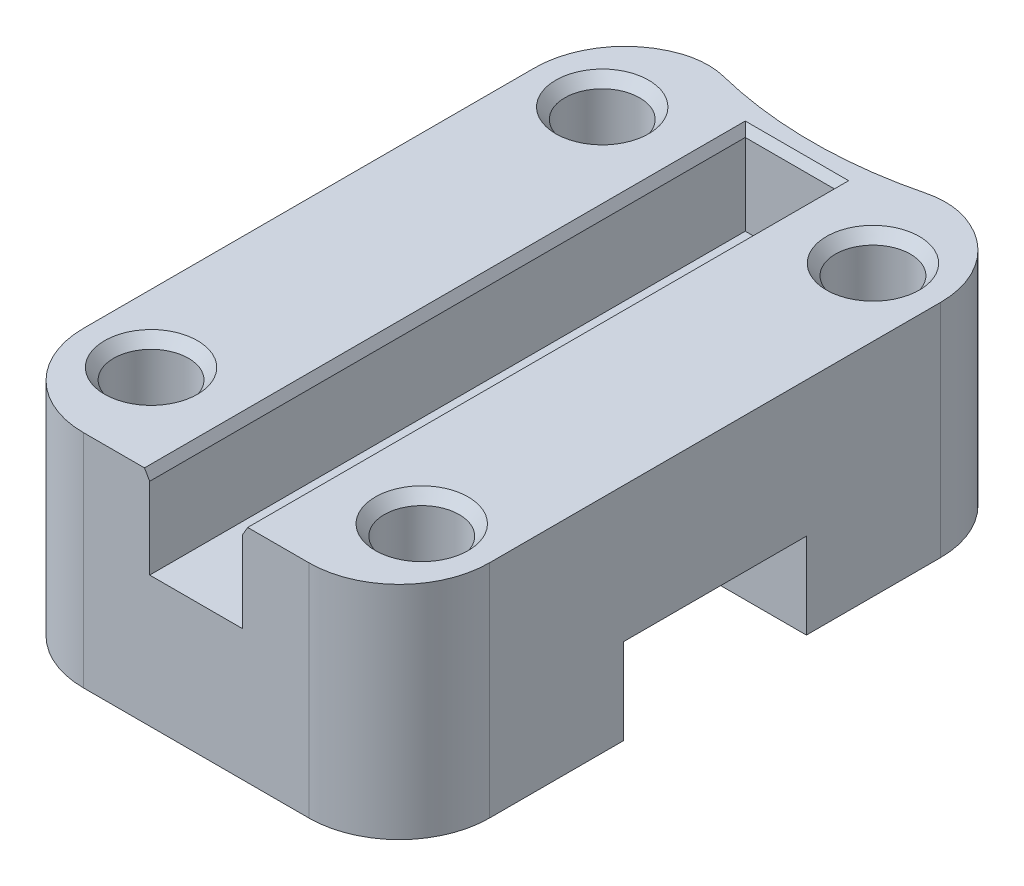
ISO-10303-21;
HEADER;
FILE_DESCRIPTION(('STEP AP214'),'2;1');
FILE_NAME('part.step','',(''),(''),'','','');
FILE_SCHEMA(('AUTOMOTIVE_DESIGN { 1 0 10303 214 1 1 1 1 }'));
ENDSEC;
DATA;
#1=APPLICATION_CONTEXT('core data for automotive mechanical design processes');
#2=APPLICATION_PROTOCOL_DEFINITION('international standard','automotive_design',2000,#1);
#3=PRODUCT_CONTEXT('',#1,'mechanical');
#4=PRODUCT('Part','Part','',(#3));
#5=PRODUCT_RELATED_PRODUCT_CATEGORY('part','',(#4));
#6=PRODUCT_DEFINITION_FORMATION('','',#4);
#7=PRODUCT_DEFINITION_CONTEXT('part definition',#1,'design');
#8=PRODUCT_DEFINITION('design','',#6,#7);
#9=PRODUCT_DEFINITION_SHAPE('','',#8);
#10=(LENGTH_UNIT() NAMED_UNIT(*) SI_UNIT(.MILLI.,.METRE.));
#11=(NAMED_UNIT(*) PLANE_ANGLE_UNIT() SI_UNIT($,.RADIAN.));
#12=(NAMED_UNIT(*) SI_UNIT($,.STERADIAN.) SOLID_ANGLE_UNIT());
#13=UNCERTAINTY_MEASURE_WITH_UNIT(LENGTH_MEASURE(1.E-05),#10,'distance_accuracy_value','');
#14=(GEOMETRIC_REPRESENTATION_CONTEXT(3) GLOBAL_UNCERTAINTY_ASSIGNED_CONTEXT((#13)) GLOBAL_UNIT_ASSIGNED_CONTEXT((#10,
#11,#12)) REPRESENTATION_CONTEXT('',''));
#15=CARTESIAN_POINT('',(0.,0.,0.));
#16=DIRECTION('',(0.,0.,1.));
#17=DIRECTION('',(1.,0.,0.));
#18=AXIS2_PLACEMENT_3D('',#15,#16,#17);
#19=CARTESIAN_POINT('',(0.,0.,0.));
#20=DIRECTION('',(0.,1.,0.));
#21=DIRECTION('',(0.,0.,1.));
#22=AXIS2_PLACEMENT_3D('',#19,#20,#21);
#23=PLANE('',#22);
#24=CARTESIAN_POINT('',(-15.,0.,25.));
#25=DIRECTION('',(0.,-1.,0.));
#26=DIRECTION('',(0.,0.,-1.));
#27=AXIS2_PLACEMENT_3D('',#24,#25,#26);
#28=CIRCLE('',#27,4.15);
#29=CARTESIAN_POINT('',(-15.,0.,20.85));
#30=VERTEX_POINT('',#29);
#31=EDGE_CURVE('E224',#30,#30,#28,.T.);
#32=ORIENTED_EDGE('',*,*,#31,.F.);
#33=EDGE_LOOP('',(#32));
#34=FACE_BOUND('',#33,.T.);
#35=CARTESIAN_POINT('',(15.,0.,25.));
#36=DIRECTION('',(0.,-1.,0.));
#37=DIRECTION('',(0.,0.,-1.));
#38=AXIS2_PLACEMENT_3D('',#35,#36,#37);
#39=CIRCLE('',#38,4.15);
#40=CARTESIAN_POINT('',(15.,0.,20.85));
#41=VERTEX_POINT('',#40);
#42=EDGE_CURVE('E228',#41,#41,#39,.T.);
#43=ORIENTED_EDGE('',*,*,#42,.F.);
#44=EDGE_LOOP('',(#43));
#45=FACE_BOUND('',#44,.T.);
#46=DIRECTION('',(1.,0.,0.));
#47=VECTOR('',#46,1.);
#48=CARTESIAN_POINT('',(22.5,0.,35.));
#49=LINE('',#48,#47);
#50=CARTESIAN_POINT('',(-12.5,0.,35.));
#51=VERTEX_POINT('',#50);
#52=CARTESIAN_POINT('',(12.5,0.,35.));
#53=VERTEX_POINT('',#52);
#54=EDGE_CURVE('E268',#51,#53,#49,.T.);
#55=ORIENTED_EDGE('',*,*,#54,.F.);
#56=CARTESIAN_POINT('',(-12.5,0.,25.));
#57=DIRECTION('',(0.,1.,0.));
#58=DIRECTION('',(0.,0.,1.));
#59=AXIS2_PLACEMENT_3D('',#56,#57,#58);
#60=CIRCLE('',#59,10.);
#61=CARTESIAN_POINT('',(-22.5,0.,25.));
#62=VERTEX_POINT('',#61);
#63=EDGE_CURVE('E327',#51,#62,#60,.F.);
#64=ORIENTED_EDGE('',*,*,#63,.T.);
#65=DIRECTION('',(0.,0.,1.));
#66=VECTOR('',#65,1.);
#67=CARTESIAN_POINT('',(-22.5,0.,35.));
#68=LINE('',#67,#66);
#69=CARTESIAN_POINT('',(-22.5,0.,10.125));
#70=VERTEX_POINT('',#69);
#71=EDGE_CURVE('E261',#70,#62,#68,.T.);
#72=ORIENTED_EDGE('',*,*,#71,.F.);
#73=DIRECTION('',(1.,0.,0.));
#74=VECTOR('',#73,1.);
#75=CARTESIAN_POINT('',(-22.5,0.,10.125));
#76=LINE('',#75,#74);
#77=CARTESIAN_POINT('',(22.5,0.,10.125));
#78=VERTEX_POINT('',#77);
#79=EDGE_CURVE('E244',#70,#78,#76,.T.);
#80=ORIENTED_EDGE('',*,*,#79,.T.);
#81=DIRECTION('',(0.,0.,-1.));
#82=VECTOR('',#81,1.);
#83=CARTESIAN_POINT('',(22.5,0.,35.));
#84=LINE('',#83,#82);
#85=CARTESIAN_POINT('',(22.5,0.,25.));
#86=VERTEX_POINT('',#85);
#87=EDGE_CURVE('E265',#86,#78,#84,.T.);
#88=ORIENTED_EDGE('',*,*,#87,.F.);
#89=CARTESIAN_POINT('',(12.5,0.,25.));
#90=DIRECTION('',(0.,1.,0.));
#91=DIRECTION('',(0.,0.,1.));
#92=AXIS2_PLACEMENT_3D('',#89,#90,#91);
#93=CIRCLE('',#92,10.);
#94=EDGE_CURVE('E325',#86,#53,#93,.F.);
#95=ORIENTED_EDGE('',*,*,#94,.T.);
#96=EDGE_LOOP('',(#55,#64,#72,#80,#88,#95));
#97=FACE_BOUND('',#96,.T.);
#98=ADVANCED_FACE('F34',(#34,#45,#97),#23,.F.);
#99=CARTESIAN_POINT('',(-22.5,14.5,35.));
#100=DIRECTION('',(1.,0.,0.));
#101=DIRECTION('',(0.,0.,-1.));
#102=AXIS2_PLACEMENT_3D('',#99,#100,#101);
#103=PLANE('',#102);
#104=ORIENTED_EDGE('',*,*,#71,.T.);
#105=DIRECTION('',(0.,-1.,0.));
#106=VECTOR('',#105,1.);
#107=CARTESIAN_POINT('',(-22.5,14.5,25.));
#108=LINE('',#107,#106);
#109=CARTESIAN_POINT('',(-22.5,24.5,25.));
#110=VERTEX_POINT('',#109);
#111=EDGE_CURVE('E332',#62,#110,#108,.F.);
#112=ORIENTED_EDGE('',*,*,#111,.T.);
#113=DIRECTION('',(0.,0.,1.));
#114=VECTOR('',#113,1.);
#115=CARTESIAN_POINT('',(-22.5,24.5,35.));
#116=LINE('',#115,#114);
#117=CARTESIAN_POINT('',(-22.5,24.5,-25.));
#118=VERTEX_POINT('',#117);
#119=EDGE_CURVE('E216',#118,#110,#116,.T.);
#120=ORIENTED_EDGE('',*,*,#119,.F.);
#121=DIRECTION('',(0.,-1.,0.));
#122=VECTOR('',#121,1.);
#123=CARTESIAN_POINT('',(-22.5,14.5,-25.));
#124=LINE('',#123,#122);
#125=CARTESIAN_POINT('',(-22.5,0.,-25.));
#126=VERTEX_POINT('',#125);
#127=EDGE_CURVE('E329',#118,#126,#124,.T.);
#128=ORIENTED_EDGE('',*,*,#127,.T.);
#129=CARTESIAN_POINT('',(-22.5,0.,-10.125));
#130=VERTEX_POINT('',#129);
#131=EDGE_CURVE('E266',#126,#130,#68,.T.);
#132=ORIENTED_EDGE('',*,*,#131,.T.);
#133=DIRECTION('',(0.,1.,0.));
#134=VECTOR('',#133,1.);
#135=CARTESIAN_POINT('',(-22.5,9.50000000000001,-10.125));
#136=LINE('',#135,#134);
#137=CARTESIAN_POINT('',(-22.5,9.50000000000001,-10.125));
#138=VERTEX_POINT('',#137);
#139=EDGE_CURVE('E238',#130,#138,#136,.T.);
#140=ORIENTED_EDGE('',*,*,#139,.T.);
#141=DIRECTION('',(0.,0.,1.));
#142=VECTOR('',#141,1.);
#143=CARTESIAN_POINT('',(-22.5,9.50000000000001,-10.125));
#144=LINE('',#143,#142);
#145=CARTESIAN_POINT('',(-22.5,9.5,10.125));
#146=VERTEX_POINT('',#145);
#147=EDGE_CURVE('E241',#138,#146,#144,.T.);
#148=ORIENTED_EDGE('',*,*,#147,.T.);
#149=DIRECTION('',(0.,-1.,0.));
#150=VECTOR('',#149,1.);
#151=CARTESIAN_POINT('',(-22.5,9.5,10.125));
#152=LINE('',#151,#150);
#153=EDGE_CURVE('E235',#146,#70,#152,.T.);
#154=ORIENTED_EDGE('',*,*,#153,.T.);
#155=EDGE_LOOP('',(#104,#112,#120,#128,#132,#140,#148,#154));
#156=FACE_BOUND('',#155,.T.);
#157=ADVANCED_FACE('F386',(#156),#103,.F.);
#158=CARTESIAN_POINT('',(22.5,14.5,35.));
#159=DIRECTION('',(0.,0.,-1.));
#160=DIRECTION('',(-1.,0.,0.));
#161=AXIS2_PLACEMENT_3D('',#158,#159,#160);
#162=PLANE('',#161);
#163=DIRECTION('',(1.,0.,0.));
#164=VECTOR('',#163,1.);
#165=CARTESIAN_POINT('',(-5.15,24.5,35.));
#166=LINE('',#165,#164);
#167=CARTESIAN_POINT('',(-12.5,24.5,35.));
#168=VERTEX_POINT('',#167);
#169=CARTESIAN_POINT('',(-5.72735026918963,24.5,35.));
#170=VERTEX_POINT('',#169);
#171=EDGE_CURVE('E417',#168,#170,#166,.T.);
#172=ORIENTED_EDGE('',*,*,#171,.F.);
#173=DIRECTION('',(0.,-1.,0.));
#174=VECTOR('',#173,1.);
#175=CARTESIAN_POINT('',(-12.5,14.5,35.));
#176=LINE('',#175,#174);
#177=EDGE_CURVE('E322',#168,#51,#176,.T.);
#178=ORIENTED_EDGE('',*,*,#177,.T.);
#179=ORIENTED_EDGE('',*,*,#54,.T.);
#180=DIRECTION('',(0.,-1.,0.));
#181=VECTOR('',#180,1.);
#182=CARTESIAN_POINT('',(12.5,14.5,35.));
#183=LINE('',#182,#181);
#184=CARTESIAN_POINT('',(12.5,24.5,35.));
#185=VERTEX_POINT('',#184);
#186=EDGE_CURVE('E318',#53,#185,#183,.F.);
#187=ORIENTED_EDGE('',*,*,#186,.T.);
#188=DIRECTION('',(1.,0.,0.));
#189=VECTOR('',#188,1.);
#190=CARTESIAN_POINT('',(5.15,24.5,35.));
#191=LINE('',#190,#189);
#192=CARTESIAN_POINT('',(5.70756444527081,24.5,35.));
#193=VERTEX_POINT('',#192);
#194=EDGE_CURVE('E420',#193,#185,#191,.T.);
#195=ORIENTED_EDGE('',*,*,#194,.F.);
#196=DIRECTION('',(-0.500000016850885,-0.866025394055576,0.));
#197=VECTOR('',#196,1.);
#198=CARTESIAN_POINT('',(5.71018744100996,24.5045431616841,35.));
#199=LINE('',#198,#197);
#200=CARTESIAN_POINT('',(5.15,23.5342700956927,35.));
#201=VERTEX_POINT('',#200);
#202=EDGE_CURVE('E308',#193,#201,#199,.T.);
#203=ORIENTED_EDGE('',*,*,#202,.T.);
#204=DIRECTION('',(0.,-1.,0.));
#205=VECTOR('',#204,1.);
#206=CARTESIAN_POINT('',(5.15,24.5,35.));
#207=LINE('',#206,#205);
#208=CARTESIAN_POINT('',(5.15,14.5,35.));
#209=VERTEX_POINT('',#208);
#210=EDGE_CURVE('E217',#201,#209,#207,.T.);
#211=ORIENTED_EDGE('',*,*,#210,.T.);
#212=DIRECTION('',(1.,0.,0.));
#213=VECTOR('',#212,1.);
#214=CARTESIAN_POINT('',(22.5,14.5,35.));
#215=LINE('',#214,#213);
#216=CARTESIAN_POINT('',(-5.15,14.5,35.));
#217=VERTEX_POINT('',#216);
#218=EDGE_CURVE('E262',#217,#209,#215,.T.);
#219=ORIENTED_EDGE('',*,*,#218,.F.);
#220=DIRECTION('',(0.,-1.,0.));
#221=VECTOR('',#220,1.);
#222=CARTESIAN_POINT('',(-5.15,24.5,35.));
#223=LINE('',#222,#221);
#224=CARTESIAN_POINT('',(-5.15,23.5,35.));
#225=VERTEX_POINT('',#224);
#226=EDGE_CURVE('E187',#225,#217,#223,.T.);
#227=ORIENTED_EDGE('',*,*,#226,.F.);
#228=DIRECTION('',(-0.499999999999997,0.86602540378444,0.));
#229=VECTOR('',#228,1.);
#230=CARTESIAN_POINT('',(-5.72735026918963,24.5,35.));
#231=LINE('',#230,#229);
#232=EDGE_CURVE('E310',#225,#170,#231,.T.);
#233=ORIENTED_EDGE('',*,*,#232,.T.);
#234=EDGE_LOOP('',(#172,#178,#179,#187,#195,#203,#211,#219,#227,#233));
#235=FACE_BOUND('',#234,.T.);
#236=ADVANCED_FACE('F415',(#235),#162,.F.);
#237=CARTESIAN_POINT('',(22.5,14.5,35.));
#238=DIRECTION('',(-1.,0.,0.));
#239=DIRECTION('',(0.,0.,1.));
#240=AXIS2_PLACEMENT_3D('',#237,#238,#239);
#241=PLANE('',#240);
#242=DIRECTION('',(0.,0.,-1.));
#243=VECTOR('',#242,1.);
#244=CARTESIAN_POINT('',(22.5,24.5,35.));
#245=LINE('',#244,#243);
#246=CARTESIAN_POINT('',(22.5,24.5,25.));
#247=VERTEX_POINT('',#246);
#248=CARTESIAN_POINT('',(22.5,24.5,-25.));
#249=VERTEX_POINT('',#248);
#250=EDGE_CURVE('E209',#247,#249,#245,.T.);
#251=ORIENTED_EDGE('',*,*,#250,.F.);
#252=DIRECTION('',(0.,-1.,0.));
#253=VECTOR('',#252,1.);
#254=CARTESIAN_POINT('',(22.5,14.5,25.));
#255=LINE('',#254,#253);
#256=EDGE_CURVE('E345',#247,#86,#255,.T.);
#257=ORIENTED_EDGE('',*,*,#256,.T.);
#258=ORIENTED_EDGE('',*,*,#87,.T.);
#259=DIRECTION('',(0.,1.,0.));
#260=VECTOR('',#259,1.);
#261=CARTESIAN_POINT('',(22.5,14.5,10.125));
#262=LINE('',#261,#260);
#263=CARTESIAN_POINT('',(22.5,9.5,10.125));
#264=VERTEX_POINT('',#263);
#265=EDGE_CURVE('E258',#78,#264,#262,.T.);
#266=ORIENTED_EDGE('',*,*,#265,.T.);
#267=DIRECTION('',(0.,0.,-1.));
#268=VECTOR('',#267,1.);
#269=CARTESIAN_POINT('',(22.5,9.5,35.));
#270=LINE('',#269,#268);
#271=CARTESIAN_POINT('',(22.5,9.50000000000001,-10.125));
#272=VERTEX_POINT('',#271);
#273=EDGE_CURVE('E264',#264,#272,#270,.T.);
#274=ORIENTED_EDGE('',*,*,#273,.T.);
#275=DIRECTION('',(0.,-1.,0.));
#276=VECTOR('',#275,1.);
#277=CARTESIAN_POINT('',(22.5,14.5,-10.125));
#278=LINE('',#277,#276);
#279=CARTESIAN_POINT('',(22.5,0.,-10.125));
#280=VERTEX_POINT('',#279);
#281=EDGE_CURVE('E248',#272,#280,#278,.T.);
#282=ORIENTED_EDGE('',*,*,#281,.T.);
#283=CARTESIAN_POINT('',(22.5,0.,-25.));
#284=VERTEX_POINT('',#283);
#285=EDGE_CURVE('E271',#280,#284,#84,.T.);
#286=ORIENTED_EDGE('',*,*,#285,.T.);
#287=DIRECTION('',(0.,-1.,0.));
#288=VECTOR('',#287,1.);
#289=CARTESIAN_POINT('',(22.5,14.5,-25.));
#290=LINE('',#289,#288);
#291=EDGE_CURVE('E343',#284,#249,#290,.F.);
#292=ORIENTED_EDGE('',*,*,#291,.T.);
#293=EDGE_LOOP('',(#251,#257,#258,#266,#274,#282,#286,#292));
#294=FACE_BOUND('',#293,.T.);
#295=ADVANCED_FACE('F395',(#294),#241,.F.);
#296=CARTESIAN_POINT('',(0.,14.5,0.));
#297=DIRECTION('',(0.,1.,0.));
#298=DIRECTION('',(0.,0.,1.));
#299=AXIS2_PLACEMENT_3D('',#296,#297,#298);
#300=PLANE('',#299);
#301=DIRECTION('',(0.363344208928321,0.,0.93165497145577));
#302=VECTOR('',#301,1.);
#303=CARTESIAN_POINT('',(5.15,14.5,35.));
#304=LINE('',#303,#302);
#305=CARTESIAN_POINT('',(5.13022934751461,14.5,34.9493058476664));
#306=VERTEX_POINT('',#305);
#307=EDGE_CURVE('E213',#306,#209,#304,.T.);
#308=ORIENTED_EDGE('',*,*,#307,.F.);
#309=DIRECTION('',(-0.000299785590505607,0.,0.999999955064299));
#310=VECTOR('',#309,1.);
#311=CARTESIAN_POINT('',(5.15,14.5,-31.));
#312=LINE('',#311,#310);
#313=CARTESIAN_POINT('',(5.15,14.5,-31.));
#314=VERTEX_POINT('',#313);
#315=EDGE_CURVE('E199',#314,#306,#312,.T.);
#316=ORIENTED_EDGE('',*,*,#315,.F.);
#317=DIRECTION('',(1.,0.,0.));
#318=VECTOR('',#317,1.);
#319=CARTESIAN_POINT('',(-5.15,14.5,-31.));
#320=LINE('',#319,#318);
#321=CARTESIAN_POINT('',(-5.15,14.5,-31.));
#322=VERTEX_POINT('',#321);
#323=EDGE_CURVE('E181',#322,#314,#320,.T.);
#324=ORIENTED_EDGE('',*,*,#323,.F.);
#325=DIRECTION('',(0.,0.,-1.));
#326=VECTOR('',#325,1.);
#327=CARTESIAN_POINT('',(-5.15,14.5,35.));
#328=LINE('',#327,#326);
#329=EDGE_CURVE('E196',#217,#322,#328,.T.);
#330=ORIENTED_EDGE('',*,*,#329,.F.);
#331=ORIENTED_EDGE('',*,*,#218,.T.);
#332=EDGE_LOOP('',(#308,#316,#324,#330,#331));
#333=FACE_BOUND('',#332,.T.);
#334=ADVANCED_FACE('F194',(#333),#300,.T.);
#335=CARTESIAN_POINT('',(15.,0.,-25.));
#336=DIRECTION('',(0.,-1.,0.));
#337=DIRECTION('',(0.,0.,-1.));
#338=AXIS2_PLACEMENT_3D('',#335,#336,#337);
#339=CIRCLE('',#338,4.15);
#340=CARTESIAN_POINT('',(15.,0.,-29.15));
#341=VERTEX_POINT('',#340);
#342=EDGE_CURVE('E223',#341,#341,#339,.T.);
#343=ORIENTED_EDGE('',*,*,#342,.F.);
#344=EDGE_LOOP('',(#343));
#345=FACE_BOUND('',#344,.T.);
#346=CARTESIAN_POINT('',(-15.,0.,-25.));
#347=DIRECTION('',(0.,-1.,0.));
#348=DIRECTION('',(0.,0.,-1.));
#349=AXIS2_PLACEMENT_3D('',#346,#347,#348);
#350=CIRCLE('',#349,4.15);
#351=CARTESIAN_POINT('',(-15.,0.,-29.15));
#352=VERTEX_POINT('',#351);
#353=EDGE_CURVE('E227',#352,#352,#350,.T.);
#354=ORIENTED_EDGE('',*,*,#353,.F.);
#355=EDGE_LOOP('',(#354));
#356=FACE_BOUND('',#355,.T.);
#357=CARTESIAN_POINT('',(-12.5,0.,-25.));
#358=DIRECTION('',(0.,1.,0.));
#359=DIRECTION('',(0.,0.,1.));
#360=AXIS2_PLACEMENT_3D('',#357,#358,#359);
#361=CIRCLE('',#360,10.);
#362=CARTESIAN_POINT('',(-15.7226987115136,0.,-34.46647838506));
#363=VERTEX_POINT('',#362);
#364=EDGE_CURVE('E350',#126,#363,#361,.F.);
#365=ORIENTED_EDGE('',*,*,#364,.T.);
#366=CARTESIAN_POINT('',(-13.1445397423027,0.,-26.893295677012));
#367=DIRECTION('',(0.,1.,0.));
#368=DIRECTION('',(0.,0.,1.));
#369=AXIS2_PLACEMENT_3D('',#366,#367,#368);
#370=CIRCLE('',#369,8.);
#371=CARTESIAN_POINT('',(-11.1972005212208,0.,-34.6526687159911));
#372=VERTEX_POINT('',#371);
#373=EDGE_CURVE('E42',#363,#372,#370,.F.);
#374=ORIENTED_EDGE('',*,*,#373,.T.);
#375=CARTESIAN_POINT('',(0.,0.,-79.2690636901211));
#376=DIRECTION('',(0.,-1.,0.));
#377=DIRECTION('',(0.,0.,-1.));
#378=AXIS2_PLACEMENT_3D('',#375,#376,#377);
#379=CIRCLE('',#378,46.);
#380=CARTESIAN_POINT('',(11.1972005212209,0.,-34.6526687159911));
#381=VERTEX_POINT('',#380);
#382=EDGE_CURVE('E366',#381,#372,#379,.T.);
#383=ORIENTED_EDGE('',*,*,#382,.F.);
#384=CARTESIAN_POINT('',(13.1445397423027,0.,-26.893295677012));
#385=DIRECTION('',(0.,1.,0.));
#386=DIRECTION('',(0.,0.,1.));
#387=AXIS2_PLACEMENT_3D('',#384,#385,#386);
#388=CIRCLE('',#387,8.);
#389=CARTESIAN_POINT('',(15.7226987115136,0.,-34.46647838506));
#390=VERTEX_POINT('',#389);
#391=EDGE_CURVE('E49',#381,#390,#388,.F.);
#392=ORIENTED_EDGE('',*,*,#391,.T.);
#393=CARTESIAN_POINT('',(12.5,0.,-25.));
#394=DIRECTION('',(0.,1.,0.));
#395=DIRECTION('',(0.,0.,1.));
#396=AXIS2_PLACEMENT_3D('',#393,#394,#395);
#397=CIRCLE('',#396,10.);
#398=EDGE_CURVE('E348',#390,#284,#397,.F.);
#399=ORIENTED_EDGE('',*,*,#398,.T.);
#400=ORIENTED_EDGE('',*,*,#285,.F.);
#401=DIRECTION('',(1.,0.,0.));
#402=VECTOR('',#401,1.);
#403=CARTESIAN_POINT('',(-22.5,0.,-10.125));
#404=LINE('',#403,#402);
#405=EDGE_CURVE('E252',#130,#280,#404,.T.);
#406=ORIENTED_EDGE('',*,*,#405,.F.);
#407=ORIENTED_EDGE('',*,*,#131,.F.);
#408=EDGE_LOOP('',(#365,#374,#383,#392,#399,#400,#406,#407));
#409=FACE_BOUND('',#408,.T.);
#410=ADVANCED_FACE('F365',(#345,#356,#409),#23,.F.);
#411=CARTESIAN_POINT('',(-22.5,9.50000000000001,-10.125));
#412=DIRECTION('',(0.,1.,0.));
#413=DIRECTION('',(0.,0.,1.));
#414=AXIS2_PLACEMENT_3D('',#411,#412,#413);
#415=PLANE('',#414);
#416=DIRECTION('',(1.,0.,0.));
#417=VECTOR('',#416,1.);
#418=CARTESIAN_POINT('',(-22.5,9.5,10.125));
#419=LINE('',#418,#417);
#420=EDGE_CURVE('E245',#146,#264,#419,.T.);
#421=ORIENTED_EDGE('',*,*,#420,.F.);
#422=ORIENTED_EDGE('',*,*,#147,.F.);
#423=DIRECTION('',(1.,0.,0.));
#424=VECTOR('',#423,1.);
#425=CARTESIAN_POINT('',(-22.5,9.50000000000001,-10.125));
#426=LINE('',#425,#424);
#427=EDGE_CURVE('E249',#138,#272,#426,.T.);
#428=ORIENTED_EDGE('',*,*,#427,.T.);
#429=ORIENTED_EDGE('',*,*,#273,.F.);
#430=EDGE_LOOP('',(#421,#422,#428,#429));
#431=FACE_BOUND('',#430,.T.);
#432=ADVANCED_FACE('F399',(#431),#415,.F.);
#433=CARTESIAN_POINT('',(-22.5,9.5,10.125));
#434=DIRECTION('',(0.,0.,1.));
#435=DIRECTION('',(0.,-1.,0.));
#436=AXIS2_PLACEMENT_3D('',#433,#434,#435);
#437=PLANE('',#436);
#438=ORIENTED_EDGE('',*,*,#79,.F.);
#439=ORIENTED_EDGE('',*,*,#153,.F.);
#440=ORIENTED_EDGE('',*,*,#420,.T.);
#441=ORIENTED_EDGE('',*,*,#265,.F.);
#442=EDGE_LOOP('',(#438,#439,#440,#441));
#443=FACE_BOUND('',#442,.T.);
#444=ADVANCED_FACE('F403',(#443),#437,.F.);
#445=CARTESIAN_POINT('',(-22.5,9.50000000000001,-10.125));
#446=DIRECTION('',(0.,0.,-1.));
#447=DIRECTION('',(0.,1.,0.));
#448=AXIS2_PLACEMENT_3D('',#445,#446,#447);
#449=PLANE('',#448);
#450=ORIENTED_EDGE('',*,*,#427,.F.);
#451=ORIENTED_EDGE('',*,*,#139,.F.);
#452=ORIENTED_EDGE('',*,*,#405,.T.);
#453=ORIENTED_EDGE('',*,*,#281,.F.);
#454=EDGE_LOOP('',(#450,#451,#452,#453));
#455=FACE_BOUND('',#454,.T.);
#456=ADVANCED_FACE('F392',(#455),#449,.F.);
#457=CARTESIAN_POINT('',(-15.,14.5,-25.));
#458=DIRECTION('',(0.,-1.,0.));
#459=DIRECTION('',(0.,0.,-1.));
#460=AXIS2_PLACEMENT_3D('',#457,#458,#459);
#461=CYLINDRICAL_SURFACE('',#460,4.15);
#462=CARTESIAN_POINT('',(-15.,23.3082464074057,-25.));
#463=DIRECTION('',(0.,1.,0.));
#464=DIRECTION('',(0.,0.,1.));
#465=AXIS2_PLACEMENT_3D('',#462,#463,#464);
#466=CIRCLE('',#465,4.15);
#467=CARTESIAN_POINT('',(-15.,23.3082464074057,-20.85));
#468=VERTEX_POINT('',#467);
#469=EDGE_CURVE('E293',#468,#468,#466,.T.);
#470=ORIENTED_EDGE('',*,*,#469,.T.);
#471=EDGE_LOOP('',(#470));
#472=FACE_BOUND('',#471,.T.);
#473=ORIENTED_EDGE('',*,*,#353,.T.);
#474=EDGE_LOOP('',(#473));
#475=FACE_BOUND('',#474,.T.);
#476=ADVANCED_FACE('F461',(#472,#475),#461,.F.);
#477=CARTESIAN_POINT('',(15.,14.5,-25.));
#478=DIRECTION('',(0.,-1.,0.));
#479=DIRECTION('',(0.,0.,-1.));
#480=AXIS2_PLACEMENT_3D('',#477,#478,#479);
#481=CYLINDRICAL_SURFACE('',#480,4.15);
#482=CARTESIAN_POINT('',(15.,23.3082464074057,-25.));
#483=DIRECTION('',(0.,1.,0.));
#484=DIRECTION('',(0.,0.,1.));
#485=AXIS2_PLACEMENT_3D('',#482,#483,#484);
#486=CIRCLE('',#485,4.15);
#487=CARTESIAN_POINT('',(15.,23.3082464074057,-20.85));
#488=VERTEX_POINT('',#487);
#489=EDGE_CURVE('E296',#488,#488,#486,.T.);
#490=ORIENTED_EDGE('',*,*,#489,.T.);
#491=EDGE_LOOP('',(#490));
#492=FACE_BOUND('',#491,.T.);
#493=ORIENTED_EDGE('',*,*,#342,.T.);
#494=EDGE_LOOP('',(#493));
#495=FACE_BOUND('',#494,.T.);
#496=ADVANCED_FACE('F463',(#492,#495),#481,.F.);
#497=CARTESIAN_POINT('',(15.,14.5,25.));
#498=DIRECTION('',(0.,-1.,0.));
#499=DIRECTION('',(0.,0.,-1.));
#500=AXIS2_PLACEMENT_3D('',#497,#498,#499);
#501=CYLINDRICAL_SURFACE('',#500,4.15);
#502=CARTESIAN_POINT('',(15.,23.3082464074057,25.));
#503=DIRECTION('',(0.,1.,0.));
#504=DIRECTION('',(0.,0.,1.));
#505=AXIS2_PLACEMENT_3D('',#502,#503,#504);
#506=CIRCLE('',#505,4.15);
#507=CARTESIAN_POINT('',(15.,23.3082464074057,29.15));
#508=VERTEX_POINT('',#507);
#509=EDGE_CURVE('E275',#508,#508,#506,.T.);
#510=ORIENTED_EDGE('',*,*,#509,.T.);
#511=EDGE_LOOP('',(#510));
#512=FACE_BOUND('',#511,.T.);
#513=ORIENTED_EDGE('',*,*,#42,.T.);
#514=EDGE_LOOP('',(#513));
#515=FACE_BOUND('',#514,.T.);
#516=ADVANCED_FACE('F470',(#512,#515),#501,.F.);
#517=CARTESIAN_POINT('',(-15.,14.5,25.));
#518=DIRECTION('',(0.,-1.,0.));
#519=DIRECTION('',(0.,0.,-1.));
#520=AXIS2_PLACEMENT_3D('',#517,#518,#519);
#521=CYLINDRICAL_SURFACE('',#520,4.15);
#522=CARTESIAN_POINT('',(-15.,23.3082464074057,25.));
#523=DIRECTION('',(0.,1.,0.));
#524=DIRECTION('',(0.,0.,1.));
#525=AXIS2_PLACEMENT_3D('',#522,#523,#524);
#526=CIRCLE('',#525,4.15);
#527=CARTESIAN_POINT('',(-15.,23.3082464074057,29.15));
#528=VERTEX_POINT('',#527);
#529=EDGE_CURVE('E290',#528,#528,#526,.T.);
#530=ORIENTED_EDGE('',*,*,#529,.T.);
#531=EDGE_LOOP('',(#530));
#532=FACE_BOUND('',#531,.T.);
#533=ORIENTED_EDGE('',*,*,#31,.T.);
#534=EDGE_LOOP('',(#533));
#535=FACE_BOUND('',#534,.T.);
#536=ADVANCED_FACE('F516',(#532,#535),#521,.F.);
#537=CARTESIAN_POINT('',(0.,24.5,0.));
#538=DIRECTION('',(0.,1.,0.));
#539=DIRECTION('',(0.,0.,1.));
#540=AXIS2_PLACEMENT_3D('',#537,#538,#539);
#541=PLANE('',#540);
#542=CARTESIAN_POINT('',(0.,24.5,-79.2690636901211));
#543=DIRECTION('',(0.,-1.,0.));
#544=DIRECTION('',(0.,0.,-1.));
#545=AXIS2_PLACEMENT_3D('',#542,#543,#544);
#546=CIRCLE('',#545,46.);
#547=CARTESIAN_POINT('',(11.1972005212209,24.5,-34.6526687159911));
#548=VERTEX_POINT('',#547);
#549=CARTESIAN_POINT('',(-11.1972005212208,24.5,-34.6526687159911));
#550=VERTEX_POINT('',#549);
#551=EDGE_CURVE('E319',#548,#550,#546,.T.);
#552=ORIENTED_EDGE('',*,*,#551,.T.);
#553=CARTESIAN_POINT('',(-13.1445397423027,24.5,-26.893295677012));
#554=DIRECTION('',(0.,1.,0.));
#555=DIRECTION('',(0.,0.,1.));
#556=AXIS2_PLACEMENT_3D('',#553,#554,#555);
#557=CIRCLE('',#556,8.);
#558=CARTESIAN_POINT('',(-15.7226987115136,24.5,-34.46647838506));
#559=VERTEX_POINT('',#558);
#560=EDGE_CURVE('E360',#550,#559,#557,.T.);
#561=ORIENTED_EDGE('',*,*,#560,.T.);
#562=CARTESIAN_POINT('',(-12.5,24.5,-25.));
#563=DIRECTION('',(0.,1.,0.));
#564=DIRECTION('',(0.,0.,1.));
#565=AXIS2_PLACEMENT_3D('',#562,#563,#564);
#566=CIRCLE('',#565,10.);
#567=EDGE_CURVE('E337',#559,#118,#566,.T.);
#568=ORIENTED_EDGE('',*,*,#567,.T.);
#569=ORIENTED_EDGE('',*,*,#119,.T.);
#570=CARTESIAN_POINT('',(-12.5,24.5,25.));
#571=DIRECTION('',(0.,1.,0.));
#572=DIRECTION('',(0.,0.,1.));
#573=AXIS2_PLACEMENT_3D('',#570,#571,#572);
#574=CIRCLE('',#573,10.);
#575=EDGE_CURVE('E341',#110,#168,#574,.T.);
#576=ORIENTED_EDGE('',*,*,#575,.T.);
#577=ORIENTED_EDGE('',*,*,#171,.T.);
#578=DIRECTION('',(0.,0.,-1.));
#579=VECTOR('',#578,1.);
#580=CARTESIAN_POINT('',(-5.72735026918963,24.5,-31.));
#581=LINE('',#580,#579);
#582=CARTESIAN_POINT('',(-5.72735026918963,24.5,-31.5773502691896));
#583=VERTEX_POINT('',#582);
#584=EDGE_CURVE('E303',#170,#583,#581,.T.);
#585=ORIENTED_EDGE('',*,*,#584,.T.);
#586=DIRECTION('',(1.,0.,0.));
#587=VECTOR('',#586,1.);
#588=CARTESIAN_POINT('',(5.15,24.5,-31.5773502691896));
#589=LINE('',#588,#587);
#590=CARTESIAN_POINT('',(5.72752337643242,24.5,-31.5773502691896));
#591=VERTEX_POINT('',#590);
#592=EDGE_CURVE('E301',#583,#591,#589,.T.);
#593=ORIENTED_EDGE('',*,*,#592,.T.);
#594=DIRECTION('',(-0.000299785590505607,0.,0.999999955064299));
#595=VECTOR('',#594,1.);
#596=CARTESIAN_POINT('',(5.7075795907606,24.5,34.9494789289578));
#597=LINE('',#596,#595);
#598=EDGE_CURVE('E299',#591,#193,#597,.T.);
#599=ORIENTED_EDGE('',*,*,#598,.T.);
#600=ORIENTED_EDGE('',*,*,#194,.T.);
#601=CARTESIAN_POINT('',(12.5,24.5,25.));
#602=DIRECTION('',(0.,1.,0.));
#603=DIRECTION('',(0.,0.,1.));
#604=AXIS2_PLACEMENT_3D('',#601,#602,#603);
#605=CIRCLE('',#604,10.);
#606=EDGE_CURVE('E339',#185,#247,#605,.T.);
#607=ORIENTED_EDGE('',*,*,#606,.T.);
#608=ORIENTED_EDGE('',*,*,#250,.T.);
#609=CARTESIAN_POINT('',(12.5,24.5,-25.));
#610=DIRECTION('',(0.,1.,0.));
#611=DIRECTION('',(0.,0.,1.));
#612=AXIS2_PLACEMENT_3D('',#609,#610,#611);
#613=CIRCLE('',#612,10.);
#614=CARTESIAN_POINT('',(15.7226987115136,24.5,-34.46647838506));
#615=VERTEX_POINT('',#614);
#616=EDGE_CURVE('E334',#249,#615,#613,.T.);
#617=ORIENTED_EDGE('',*,*,#616,.T.);
#618=CARTESIAN_POINT('',(13.1445397423027,24.5,-26.893295677012));
#619=DIRECTION('',(0.,1.,0.));
#620=DIRECTION('',(0.,0.,1.));
#621=AXIS2_PLACEMENT_3D('',#618,#619,#620);
#622=CIRCLE('',#621,8.);
#623=EDGE_CURVE('E358',#615,#548,#622,.T.);
#624=ORIENTED_EDGE('',*,*,#623,.T.);
#625=EDGE_LOOP('',(#552,#561,#568,#569,#576,#577,#585,#593,#599,#600,#607,#608,#617,#624));
#626=FACE_BOUND('',#625,.T.);
#627=CARTESIAN_POINT('',(15.,24.5,25.));
#628=DIRECTION('',(0.,1.,0.));
#629=DIRECTION('',(0.,0.,1.));
#630=AXIS2_PLACEMENT_3D('',#627,#628,#629);
#631=CIRCLE('',#630,5.15000000000004);
#632=CARTESIAN_POINT('',(15.,24.5,30.1500000000001));
#633=VERTEX_POINT('',#632);
#634=EDGE_CURVE('E287',#633,#633,#631,.F.);
#635=ORIENTED_EDGE('',*,*,#634,.T.);
#636=EDGE_LOOP('',(#635));
#637=FACE_BOUND('',#636,.T.);
#638=CARTESIAN_POINT('',(-15.,24.5,25.));
#639=DIRECTION('',(0.,1.,0.));
#640=DIRECTION('',(0.,0.,1.));
#641=AXIS2_PLACEMENT_3D('',#638,#639,#640);
#642=CIRCLE('',#641,5.15000000000004);
#643=CARTESIAN_POINT('',(-15.,24.5,30.1500000000001));
#644=VERTEX_POINT('',#643);
#645=EDGE_CURVE('E284',#644,#644,#642,.F.);
#646=ORIENTED_EDGE('',*,*,#645,.T.);
#647=EDGE_LOOP('',(#646));
#648=FACE_BOUND('',#647,.T.);
#649=CARTESIAN_POINT('',(-15.,24.5,-25.));
#650=DIRECTION('',(0.,1.,0.));
#651=DIRECTION('',(0.,0.,1.));
#652=AXIS2_PLACEMENT_3D('',#649,#650,#651);
#653=CIRCLE('',#652,5.15000000000004);
#654=CARTESIAN_POINT('',(-15.,24.5,-19.85));
#655=VERTEX_POINT('',#654);
#656=EDGE_CURVE('E281',#655,#655,#653,.F.);
#657=ORIENTED_EDGE('',*,*,#656,.T.);
#658=EDGE_LOOP('',(#657));
#659=FACE_BOUND('',#658,.T.);
#660=CARTESIAN_POINT('',(15.,24.5,-25.));
#661=DIRECTION('',(0.,1.,0.));
#662=DIRECTION('',(0.,0.,1.));
#663=AXIS2_PLACEMENT_3D('',#660,#661,#662);
#664=CIRCLE('',#663,5.15000000000004);
#665=CARTESIAN_POINT('',(15.,24.5,-19.85));
#666=VERTEX_POINT('',#665);
#667=EDGE_CURVE('E278',#666,#666,#664,.F.);
#668=ORIENTED_EDGE('',*,*,#667,.T.);
#669=EDGE_LOOP('',(#668));
#670=FACE_BOUND('',#669,.T.);
#671=ADVANCED_FACE('F378',(#626,#637,#648,#659,#670),#541,.T.);
#672=CARTESIAN_POINT('',(-5.15,24.5,35.));
#673=DIRECTION('',(-1.,0.,0.));
#674=DIRECTION('',(0.,0.,1.));
#675=AXIS2_PLACEMENT_3D('',#672,#673,#674);
#676=PLANE('',#675);
#677=DIRECTION('',(0.,-1.,0.));
#678=VECTOR('',#677,1.);
#679=CARTESIAN_POINT('',(-5.15,24.5,-31.));
#680=LINE('',#679,#678);
#681=CARTESIAN_POINT('',(-5.15,23.5,-31.));
#682=VERTEX_POINT('',#681);
#683=EDGE_CURVE('E177',#682,#322,#680,.T.);
#684=ORIENTED_EDGE('',*,*,#683,.F.);
#685=DIRECTION('',(0.,0.,1.));
#686=VECTOR('',#685,1.);
#687=CARTESIAN_POINT('',(-5.15,23.5,35.));
#688=LINE('',#687,#686);
#689=EDGE_CURVE('E306',#682,#225,#688,.T.);
#690=ORIENTED_EDGE('',*,*,#689,.T.);
#691=ORIENTED_EDGE('',*,*,#226,.T.);
#692=ORIENTED_EDGE('',*,*,#329,.T.);
#693=EDGE_LOOP('',(#684,#690,#691,#692));
#694=FACE_BOUND('',#693,.T.);
#695=ADVANCED_FACE('F201',(#694),#676,.F.);
#696=CARTESIAN_POINT('',(-5.15,24.5,-31.));
#697=DIRECTION('',(0.,0.,-1.));
#698=DIRECTION('',(-1.,0.,0.));
#699=AXIS2_PLACEMENT_3D('',#696,#697,#698);
#700=PLANE('',#699);
#701=DIRECTION('',(0.,-1.,0.));
#702=VECTOR('',#701,1.);
#703=CARTESIAN_POINT('',(5.15,24.5,-31.));
#704=LINE('',#703,#702);
#705=CARTESIAN_POINT('',(5.15,23.5,-31.));
#706=VERTEX_POINT('',#705);
#707=EDGE_CURVE('E188',#706,#314,#704,.T.);
#708=ORIENTED_EDGE('',*,*,#707,.F.);
#709=DIRECTION('',(-1.,0.,0.));
#710=VECTOR('',#709,1.);
#711=CARTESIAN_POINT('',(-5.15,23.5,-31.));
#712=LINE('',#711,#710);
#713=EDGE_CURVE('E183',#706,#682,#712,.T.);
#714=ORIENTED_EDGE('',*,*,#713,.T.);
#715=ORIENTED_EDGE('',*,*,#683,.T.);
#716=ORIENTED_EDGE('',*,*,#323,.T.);
#717=EDGE_LOOP('',(#708,#714,#715,#716));
#718=FACE_BOUND('',#717,.T.);
#719=ADVANCED_FACE('F180',(#718),#700,.F.);
#720=CARTESIAN_POINT('',(5.15,24.5,-31.));
#721=DIRECTION('',(0.999999955064299,0.,0.000299785590505607));
#722=DIRECTION('',(0.000299785590505607,0.,-0.999999955064299));
#723=AXIS2_PLACEMENT_3D('',#720,#721,#722);
#724=PLANE('',#723);
#725=DIRECTION('',(0.,-1.,0.));
#726=VECTOR('',#725,1.);
#727=CARTESIAN_POINT('',(5.13022934751461,24.5,34.9493058476664));
#728=LINE('',#727,#726);
#729=CARTESIAN_POINT('',(5.13022934751461,23.5,34.9493058476664));
#730=VERTEX_POINT('',#729);
#731=EDGE_CURVE('E219',#730,#306,#728,.T.);
#732=ORIENTED_EDGE('',*,*,#731,.F.);
#733=DIRECTION('',(0.000299785590505607,0.,-0.999999955064299));
#734=VECTOR('',#733,1.);
#735=CARTESIAN_POINT('',(5.15,23.5,-31.));
#736=LINE('',#735,#734);
#737=EDGE_CURVE('E316',#730,#706,#736,.T.);
#738=ORIENTED_EDGE('',*,*,#737,.T.);
#739=ORIENTED_EDGE('',*,*,#707,.T.);
#740=ORIENTED_EDGE('',*,*,#315,.T.);
#741=EDGE_LOOP('',(#732,#738,#739,#740));
#742=FACE_BOUND('',#741,.T.);
#743=ADVANCED_FACE('F593',(#742),#724,.F.);
#744=CARTESIAN_POINT('',(5.15,24.5,35.));
#745=DIRECTION('',(0.93165497145577,0.,-0.363344208928321));
#746=DIRECTION('',(-0.363344208928321,0.,-0.93165497145577));
#747=AXIS2_PLACEMENT_3D('',#744,#745,#746);
#748=PLANE('',#747);
#749=ORIENTED_EDGE('',*,*,#210,.F.);
#750=DIRECTION('',(-0.307448191419506,-0.532925200536571,-0.788331364481923));
#751=VECTOR('',#750,1.);
#752=CARTESIAN_POINT('',(-3.12064433041924,9.19808301973364,13.7931478795148));
#753=LINE('',#752,#751);
#754=EDGE_CURVE('E314',#201,#730,#753,.T.);
#755=ORIENTED_EDGE('',*,*,#754,.T.);
#756=ORIENTED_EDGE('',*,*,#731,.T.);
#757=ORIENTED_EDGE('',*,*,#307,.T.);
#758=EDGE_LOOP('',(#749,#755,#756,#757));
#759=FACE_BOUND('',#758,.T.);
#760=ADVANCED_FACE('F540',(#759),#748,.F.);
#761=CARTESIAN_POINT('',(15.,23.3082464074057,25.));
#762=DIRECTION('',(0.,1.,0.));
#763=DIRECTION('',(0.,0.,1.));
#764=AXIS2_PLACEMENT_3D('',#761,#762,#763);
#765=CONICAL_SURFACE('',#764,4.15,0.69813170079773);
#766=ORIENTED_EDGE('',*,*,#634,.F.);
#767=EDGE_LOOP('',(#766));
#768=FACE_BOUND('',#767,.T.);
#769=ORIENTED_EDGE('',*,*,#509,.F.);
#770=EDGE_LOOP('',(#769));
#771=FACE_BOUND('',#770,.T.);
#772=ADVANCED_FACE('F534',(#768,#771),#765,.F.);
#773=CARTESIAN_POINT('',(-15.,23.3082464074057,25.));
#774=DIRECTION('',(0.,1.,0.));
#775=DIRECTION('',(0.,0.,1.));
#776=AXIS2_PLACEMENT_3D('',#773,#774,#775);
#777=CONICAL_SURFACE('',#776,4.15,0.69813170079773);
#778=ORIENTED_EDGE('',*,*,#645,.F.);
#779=EDGE_LOOP('',(#778));
#780=FACE_BOUND('',#779,.T.);
#781=ORIENTED_EDGE('',*,*,#529,.F.);
#782=EDGE_LOOP('',(#781));
#783=FACE_BOUND('',#782,.T.);
#784=ADVANCED_FACE('F539',(#780,#783),#777,.F.);
#785=CARTESIAN_POINT('',(-15.,23.3082464074057,-25.));
#786=DIRECTION('',(0.,1.,0.));
#787=DIRECTION('',(0.,0.,1.));
#788=AXIS2_PLACEMENT_3D('',#785,#786,#787);
#789=CONICAL_SURFACE('',#788,4.15,0.69813170079773);
#790=ORIENTED_EDGE('',*,*,#656,.F.);
#791=EDGE_LOOP('',(#790));
#792=FACE_BOUND('',#791,.T.);
#793=ORIENTED_EDGE('',*,*,#469,.F.);
#794=EDGE_LOOP('',(#793));
#795=FACE_BOUND('',#794,.T.);
#796=ADVANCED_FACE('F552',(#792,#795),#789,.F.);
#797=CARTESIAN_POINT('',(15.,23.3082464074057,-25.));
#798=DIRECTION('',(0.,1.,0.));
#799=DIRECTION('',(0.,0.,1.));
#800=AXIS2_PLACEMENT_3D('',#797,#798,#799);
#801=CONICAL_SURFACE('',#800,4.15,0.698131700797729);
#802=ORIENTED_EDGE('',*,*,#667,.F.);
#803=EDGE_LOOP('',(#802));
#804=FACE_BOUND('',#803,.T.);
#805=ORIENTED_EDGE('',*,*,#489,.F.);
#806=EDGE_LOOP('',(#805));
#807=FACE_BOUND('',#806,.T.);
#808=ADVANCED_FACE('F562',(#804,#807),#801,.F.);
#809=CARTESIAN_POINT('',(5.71805642752021,24.5,0.0017141909996969));
#810=DIRECTION('',(-0.866025364868982,0.499999999999996,-0.000259621937066376));
#811=DIRECTION('',(0.000299785590505607,0.,-0.999999955064299));
#812=AXIS2_PLACEMENT_3D('',#809,#810,#811);
#813=PLANE('',#812);
#814=ORIENTED_EDGE('',*,*,#202,.F.);
#815=ORIENTED_EDGE('',*,*,#598,.F.);
#816=DIRECTION('',(-0.447320856486004,-0.774550216909448,0.447186776233549));
#817=VECTOR('',#816,1.);
#818=CARTESIAN_POINT('',(4.58146915302518,22.5155708492929,-30.4316395648412));
#819=LINE('',#818,#817);
#820=EDGE_CURVE('E203',#706,#591,#819,.F.);
#821=ORIENTED_EDGE('',*,*,#820,.F.);
#822=ORIENTED_EDGE('',*,*,#737,.F.);
#823=ORIENTED_EDGE('',*,*,#754,.F.);
#824=EDGE_LOOP('',(#814,#815,#821,#822,#823));
#825=FACE_BOUND('',#824,.T.);
#826=ADVANCED_FACE('F572',(#825),#813,.T.);
#827=CARTESIAN_POINT('',(0.,24.5,-31.5773502691896));
#828=DIRECTION('',(0.,0.499999999999997,0.86602540378444));
#829=DIRECTION('',(-1.,0.,0.));
#830=AXIS2_PLACEMENT_3D('',#827,#828,#829);
#831=PLANE('',#830);
#832=ORIENTED_EDGE('',*,*,#820,.T.);
#833=ORIENTED_EDGE('',*,*,#592,.F.);
#834=DIRECTION('',(0.447213595499956,-0.774596669241486,0.447213595499956));
#835=VECTOR('',#834,1.);
#836=CARTESIAN_POINT('',(0.588119784648234,13.561284993073,-25.2618802153518));
#837=LINE('',#836,#835);
#838=EDGE_CURVE('E206',#682,#583,#837,.F.);
#839=ORIENTED_EDGE('',*,*,#838,.F.);
#840=ORIENTED_EDGE('',*,*,#713,.F.);
#841=EDGE_LOOP('',(#832,#833,#839,#840));
#842=FACE_BOUND('',#841,.T.);
#843=ADVANCED_FACE('F616',(#842),#831,.T.);
#844=CARTESIAN_POINT('',(-5.72735026918963,24.5,0.));
#845=DIRECTION('',(0.86602540378444,0.499999999999997,0.));
#846=DIRECTION('',(0.,0.,1.));
#847=AXIS2_PLACEMENT_3D('',#844,#845,#846);
#848=PLANE('',#847);
#849=ORIENTED_EDGE('',*,*,#232,.F.);
#850=ORIENTED_EDGE('',*,*,#689,.F.);
#851=ORIENTED_EDGE('',*,*,#838,.T.);
#852=ORIENTED_EDGE('',*,*,#584,.F.);
#853=EDGE_LOOP('',(#849,#850,#851,#852));
#854=FACE_BOUND('',#853,.T.);
#855=ADVANCED_FACE('F626',(#854),#848,.T.);
#856=CARTESIAN_POINT('',(-12.5,14.5,25.));
#857=DIRECTION('',(0.,-1.,0.));
#858=DIRECTION('',(0.,0.,-1.));
#859=AXIS2_PLACEMENT_3D('',#856,#857,#858);
#860=CYLINDRICAL_SURFACE('',#859,10.);
#861=ORIENTED_EDGE('',*,*,#575,.F.);
#862=ORIENTED_EDGE('',*,*,#111,.F.);
#863=ORIENTED_EDGE('',*,*,#63,.F.);
#864=ORIENTED_EDGE('',*,*,#177,.F.);
#865=EDGE_LOOP('',(#861,#862,#863,#864));
#866=FACE_BOUND('',#865,.T.);
#867=ADVANCED_FACE('F412',(#866),#860,.T.);
#868=CARTESIAN_POINT('',(12.5,14.5,25.));
#869=DIRECTION('',(0.,-1.,0.));
#870=DIRECTION('',(0.,0.,-1.));
#871=AXIS2_PLACEMENT_3D('',#868,#869,#870);
#872=CYLINDRICAL_SURFACE('',#871,10.);
#873=ORIENTED_EDGE('',*,*,#606,.F.);
#874=ORIENTED_EDGE('',*,*,#186,.F.);
#875=ORIENTED_EDGE('',*,*,#94,.F.);
#876=ORIENTED_EDGE('',*,*,#256,.F.);
#877=EDGE_LOOP('',(#873,#874,#875,#876));
#878=FACE_BOUND('',#877,.T.);
#879=ADVANCED_FACE('F671',(#878),#872,.T.);
#880=CARTESIAN_POINT('',(-12.5,14.5,-25.));
#881=DIRECTION('',(0.,-1.,0.));
#882=DIRECTION('',(0.,0.,-1.));
#883=AXIS2_PLACEMENT_3D('',#880,#881,#882);
#884=CYLINDRICAL_SURFACE('',#883,10.);
#885=ORIENTED_EDGE('',*,*,#567,.F.);
#886=DIRECTION('',(0.,-1.,0.));
#887=VECTOR('',#886,1.);
#888=CARTESIAN_POINT('',(-15.7226987115136,14.5,-34.46647838506));
#889=LINE('',#888,#887);
#890=EDGE_CURVE('E57',#559,#363,#889,.T.);
#891=ORIENTED_EDGE('',*,*,#890,.T.);
#892=ORIENTED_EDGE('',*,*,#364,.F.);
#893=ORIENTED_EDGE('',*,*,#127,.F.);
#894=EDGE_LOOP('',(#885,#891,#892,#893));
#895=FACE_BOUND('',#894,.T.);
#896=ADVANCED_FACE('F383',(#895),#884,.T.);
#897=CARTESIAN_POINT('',(12.5,14.5,-25.));
#898=DIRECTION('',(0.,-1.,0.));
#899=DIRECTION('',(0.,0.,-1.));
#900=AXIS2_PLACEMENT_3D('',#897,#898,#899);
#901=CYLINDRICAL_SURFACE('',#900,10.);
#902=ORIENTED_EDGE('',*,*,#398,.F.);
#903=DIRECTION('',(0.,-1.,0.));
#904=VECTOR('',#903,1.);
#905=CARTESIAN_POINT('',(15.7226987115136,14.5,-34.46647838506));
#906=LINE('',#905,#904);
#907=EDGE_CURVE('E11',#390,#615,#906,.F.);
#908=ORIENTED_EDGE('',*,*,#907,.T.);
#909=ORIENTED_EDGE('',*,*,#616,.F.);
#910=ORIENTED_EDGE('',*,*,#291,.F.);
#911=EDGE_LOOP('',(#902,#908,#909,#910));
#912=FACE_BOUND('',#911,.T.);
#913=ADVANCED_FACE('F432',(#912),#901,.T.);
#914=CARTESIAN_POINT('',(0.,24.5,-79.2690636901211));
#915=DIRECTION('',(0.,-1.,0.));
#916=DIRECTION('',(0.,0.,-1.));
#917=AXIS2_PLACEMENT_3D('',#914,#915,#916);
#918=CYLINDRICAL_SURFACE('',#917,46.);
#919=ORIENTED_EDGE('',*,*,#382,.T.);
#920=DIRECTION('',(0.,-1.,0.));
#921=VECTOR('',#920,1.);
#922=CARTESIAN_POINT('',(-11.1972005212208,24.5,-34.6526687159911));
#923=LINE('',#922,#921);
#924=EDGE_CURVE('E355',#372,#550,#923,.F.);
#925=ORIENTED_EDGE('',*,*,#924,.T.);
#926=ORIENTED_EDGE('',*,*,#551,.F.);
#927=DIRECTION('',(0.,-1.,0.));
#928=VECTOR('',#927,1.);
#929=CARTESIAN_POINT('',(11.1972005212208,24.5,-34.6526687159911));
#930=LINE('',#929,#928);
#931=EDGE_CURVE('E352',#548,#381,#930,.T.);
#932=ORIENTED_EDGE('',*,*,#931,.T.);
#933=EDGE_LOOP('',(#919,#925,#926,#932));
#934=FACE_BOUND('',#933,.T.);
#935=ADVANCED_FACE('F371',(#934),#918,.F.);
#936=CARTESIAN_POINT('',(-13.1445397423027,14.5,-26.893295677012));
#937=DIRECTION('',(0.,-1.,0.));
#938=DIRECTION('',(0.,0.,-1.));
#939=AXIS2_PLACEMENT_3D('',#936,#937,#938);
#940=CYLINDRICAL_SURFACE('',#939,8.);
#941=ORIENTED_EDGE('',*,*,#373,.F.);
#942=ORIENTED_EDGE('',*,*,#890,.F.);
#943=ORIENTED_EDGE('',*,*,#560,.F.);
#944=ORIENTED_EDGE('',*,*,#924,.F.);
#945=EDGE_LOOP('',(#941,#942,#943,#944));
#946=FACE_BOUND('',#945,.T.);
#947=ADVANCED_FACE('F376',(#946),#940,.T.);
#948=CARTESIAN_POINT('',(13.1445397423027,14.5,-26.893295677012));
#949=DIRECTION('',(0.,1.,0.));
#950=DIRECTION('',(0.,0.,1.));
#951=AXIS2_PLACEMENT_3D('',#948,#949,#950);
#952=CYLINDRICAL_SURFACE('',#951,8.);
#953=ORIENTED_EDGE('',*,*,#623,.F.);
#954=ORIENTED_EDGE('',*,*,#907,.F.);
#955=ORIENTED_EDGE('',*,*,#391,.F.);
#956=ORIENTED_EDGE('',*,*,#931,.F.);
#957=EDGE_LOOP('',(#953,#954,#955,#956));
#958=FACE_BOUND('',#957,.T.);
#959=ADVANCED_FACE('F36',(#958),#952,.T.);
#960=CLOSED_SHELL('',(#98,#157,#236,#295,#334,#410,#432,#444,#456,#476,#496,#516,#536,#671,#695,
#719,#743,#760,#772,#784,#796,#808,#826,#843,#855,#867,#879,#896,#913,#935,#947,#959));
#961=MANIFOLD_SOLID_BREP('B2',#960);
#962=ADVANCED_BREP_SHAPE_REPRESENTATION('',(#18,#961),#14);
#963=SHAPE_DEFINITION_REPRESENTATION(#9,#962);
ENDSEC;
END-ISO-10303-21;
